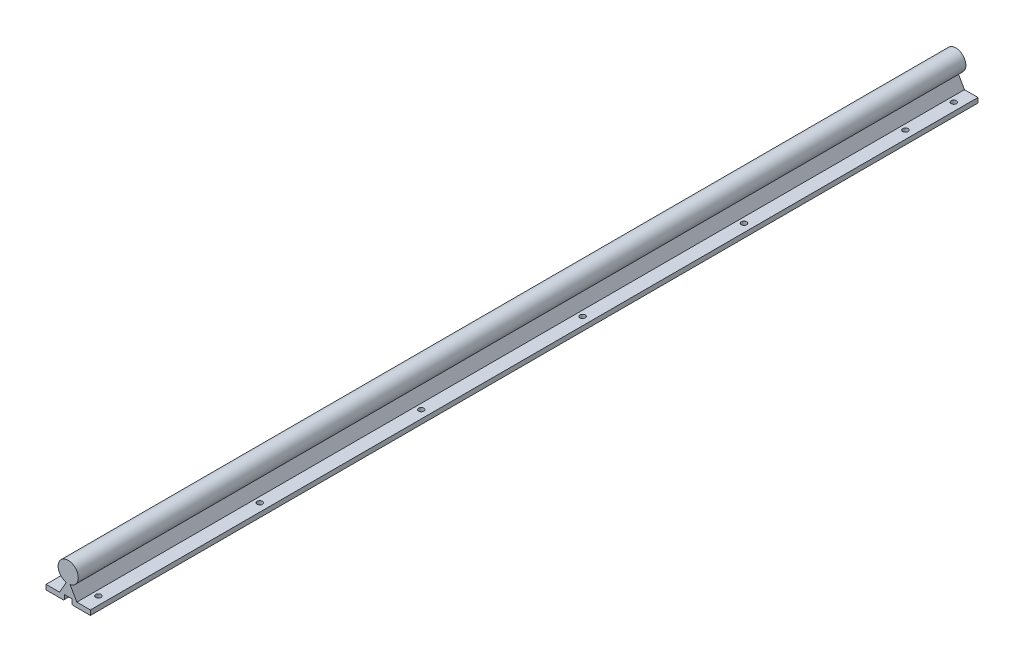
ISO-10303-21;
HEADER;
FILE_DESCRIPTION(('STEP AP214'),'2;1');
FILE_NAME('part.step','',(''),(''),'','','');
FILE_SCHEMA(('AUTOMOTIVE_DESIGN { 1 0 10303 214 1 1 1 1 }'));
ENDSEC;
DATA;
#1=APPLICATION_CONTEXT('core data for automotive mechanical design processes');
#2=APPLICATION_PROTOCOL_DEFINITION('international standard','automotive_design',2000,#1);
#3=PRODUCT_CONTEXT('',#1,'mechanical');
#4=PRODUCT('Part','Part','',(#3));
#5=PRODUCT_RELATED_PRODUCT_CATEGORY('part','',(#4));
#6=PRODUCT_DEFINITION_FORMATION('','',#4);
#7=PRODUCT_DEFINITION_CONTEXT('part definition',#1,'design');
#8=PRODUCT_DEFINITION('design','',#6,#7);
#9=PRODUCT_DEFINITION_SHAPE('','',#8);
#10=(LENGTH_UNIT() NAMED_UNIT(*) SI_UNIT(.MILLI.,.METRE.));
#11=(NAMED_UNIT(*) PLANE_ANGLE_UNIT() SI_UNIT($,.RADIAN.));
#12=(NAMED_UNIT(*) SI_UNIT($,.STERADIAN.) SOLID_ANGLE_UNIT());
#13=UNCERTAINTY_MEASURE_WITH_UNIT(LENGTH_MEASURE(1.E-05),#10,'distance_accuracy_value','');
#14=(GEOMETRIC_REPRESENTATION_CONTEXT(3) GLOBAL_UNCERTAINTY_ASSIGNED_CONTEXT((#13)) GLOBAL_UNIT_ASSIGNED_CONTEXT((#10,
#11,#12)) REPRESENTATION_CONTEXT('',''));
#15=CARTESIAN_POINT('',(0.,0.,0.));
#16=DIRECTION('',(0.,0.,1.));
#17=DIRECTION('',(1.,0.,0.));
#18=AXIS2_PLACEMENT_3D('',#15,#16,#17);
#19=CARTESIAN_POINT('',(0.,33.,-1100.));
#20=DIRECTION('',(0.,0.,1.));
#21=DIRECTION('',(1.,0.,0.));
#22=AXIS2_PLACEMENT_3D('',#19,#20,#21);
#23=CYLINDRICAL_SURFACE('',#22,12.5);
#24=CARTESIAN_POINT('',(0.,33.,0.));
#25=DIRECTION('',(0.,0.,1.));
#26=DIRECTION('',(1.,0.,0.));
#27=AXIS2_PLACEMENT_3D('',#24,#25,#26);
#28=CIRCLE('',#27,12.5);
#29=CARTESIAN_POINT('',(2.25953540055394,20.7059160661055,0.));
#30=VERTEX_POINT('',#29);
#31=CARTESIAN_POINT('',(-2.25953540055394,20.7059160661055,0.));
#32=VERTEX_POINT('',#31);
#33=EDGE_CURVE('E200',#30,#32,#28,.T.);
#34=ORIENTED_EDGE('',*,*,#33,.F.);
#35=DIRECTION('',(0.,0.,1.));
#36=VECTOR('',#35,1.);
#37=CARTESIAN_POINT('',(2.25953540055394,20.7059160661055,-1100.));
#38=LINE('',#37,#36);
#39=CARTESIAN_POINT('',(2.25953540055394,20.7059160661055,-1100.));
#40=VERTEX_POINT('',#39);
#41=EDGE_CURVE('E168',#40,#30,#38,.T.);
#42=ORIENTED_EDGE('',*,*,#41,.F.);
#43=CARTESIAN_POINT('',(0.,33.,-1100.));
#44=DIRECTION('',(0.,0.,1.));
#45=DIRECTION('',(1.,0.,0.));
#46=AXIS2_PLACEMENT_3D('',#43,#44,#45);
#47=CIRCLE('',#46,12.5);
#48=CARTESIAN_POINT('',(-2.25953540055394,20.7059160661055,-1100.));
#49=VERTEX_POINT('',#48);
#50=EDGE_CURVE('E149',#40,#49,#47,.T.);
#51=ORIENTED_EDGE('',*,*,#50,.T.);
#52=DIRECTION('',(0.,0.,1.));
#53=VECTOR('',#52,1.);
#54=CARTESIAN_POINT('',(-2.25953540055394,20.7059160661055,-1100.));
#55=LINE('',#54,#53);
#56=EDGE_CURVE('E158',#49,#32,#55,.T.);
#57=ORIENTED_EDGE('',*,*,#56,.T.);
#58=EDGE_LOOP('',(#34,#42,#51,#57));
#59=FACE_BOUND('',#58,.T.);
#60=ADVANCED_FACE('F41',(#59),#23,.T.);
#61=CARTESIAN_POINT('',(10.6605762113533,6.15488654534137,-1100.));
#62=DIRECTION('',(0.866025403784438,0.500000000000001,0.));
#63=DIRECTION('',(-0.500000000000001,0.866025403784438,0.));
#64=AXIS2_PLACEMENT_3D('',#61,#62,#63);
#65=PLANE('',#64);
#66=DIRECTION('',(-0.500000000000001,0.866025403784438,0.));
#67=VECTOR('',#66,1.);
#68=CARTESIAN_POINT('',(10.6605762113533,6.15488654534137,0.));
#69=LINE('',#68,#67);
#70=CARTESIAN_POINT('',(10.75,6.,0.));
#71=VERTEX_POINT('',#70);
#72=EDGE_CURVE('E169',#71,#30,#69,.T.);
#73=ORIENTED_EDGE('',*,*,#72,.F.);
#74=DIRECTION('',(0.,0.,1.));
#75=VECTOR('',#74,1.);
#76=CARTESIAN_POINT('',(10.75,6.,-1100.));
#77=LINE('',#76,#75);
#78=CARTESIAN_POINT('',(10.75,6.,-1100.));
#79=VERTEX_POINT('',#78);
#80=EDGE_CURVE('E226',#79,#71,#77,.T.);
#81=ORIENTED_EDGE('',*,*,#80,.F.);
#82=DIRECTION('',(-0.500000000000001,0.866025403784438,0.));
#83=VECTOR('',#82,1.);
#84=CARTESIAN_POINT('',(10.6605762113533,6.15488654534137,-1100.));
#85=LINE('',#84,#83);
#86=EDGE_CURVE('E166',#79,#40,#85,.T.);
#87=ORIENTED_EDGE('',*,*,#86,.T.);
#88=ORIENTED_EDGE('',*,*,#41,.T.);
#89=EDGE_LOOP('',(#73,#81,#87,#88));
#90=FACE_BOUND('',#89,.T.);
#91=ADVANCED_FACE('F312',(#90),#65,.T.);
#92=CARTESIAN_POINT('',(0.,6.,-1100.));
#93=DIRECTION('',(0.,1.,0.));
#94=DIRECTION('',(0.,0.,1.));
#95=AXIS2_PLACEMENT_3D('',#92,#93,#94);
#96=PLANE('',#95);
#97=CARTESIAN_POINT('',(17.5,6.,-1020.));
#98=DIRECTION('',(0.,1.,0.));
#99=DIRECTION('',(0.,0.,1.));
#100=AXIS2_PLACEMENT_3D('',#97,#98,#99);
#101=CIRCLE('',#100,3.30000000000002);
#102=CARTESIAN_POINT('',(17.5,6.,-1016.7));
#103=VERTEX_POINT('',#102);
#104=EDGE_CURVE('E175',#103,#103,#101,.T.);
#105=ORIENTED_EDGE('',*,*,#104,.F.);
#106=EDGE_LOOP('',(#105));
#107=FACE_BOUND('',#106,.T.);
#108=CARTESIAN_POINT('',(17.5,6.,-420.));
#109=DIRECTION('',(0.,1.,0.));
#110=DIRECTION('',(0.,0.,1.));
#111=AXIS2_PLACEMENT_3D('',#108,#109,#110);
#112=CIRCLE('',#111,3.30000000000001);
#113=CARTESIAN_POINT('',(17.5,6.,-416.7));
#114=VERTEX_POINT('',#113);
#115=EDGE_CURVE('E298',#114,#114,#112,.T.);
#116=ORIENTED_EDGE('',*,*,#115,.F.);
#117=EDGE_LOOP('',(#116));
#118=FACE_BOUND('',#117,.T.);
#119=CARTESIAN_POINT('',(17.5,6.,-220.));
#120=DIRECTION('',(0.,1.,0.));
#121=DIRECTION('',(0.,0.,1.));
#122=AXIS2_PLACEMENT_3D('',#119,#120,#121);
#123=CIRCLE('',#122,3.30000000000001);
#124=CARTESIAN_POINT('',(17.5,6.,-216.7));
#125=VERTEX_POINT('',#124);
#126=EDGE_CURVE('E296',#125,#125,#123,.T.);
#127=ORIENTED_EDGE('',*,*,#126,.F.);
#128=EDGE_LOOP('',(#127));
#129=FACE_BOUND('',#128,.T.);
#130=CARTESIAN_POINT('',(17.5,6.,-820.));
#131=DIRECTION('',(0.,1.,0.));
#132=DIRECTION('',(0.,0.,1.));
#133=AXIS2_PLACEMENT_3D('',#130,#131,#132);
#134=CIRCLE('',#133,3.30000000000002);
#135=CARTESIAN_POINT('',(17.5,6.,-816.7));
#136=VERTEX_POINT('',#135);
#137=EDGE_CURVE('E293',#136,#136,#134,.T.);
#138=ORIENTED_EDGE('',*,*,#137,.F.);
#139=EDGE_LOOP('',(#138));
#140=FACE_BOUND('',#139,.T.);
#141=CARTESIAN_POINT('',(17.5,6.,-620.));
#142=DIRECTION('',(0.,1.,0.));
#143=DIRECTION('',(0.,0.,1.));
#144=AXIS2_PLACEMENT_3D('',#141,#142,#143);
#145=CIRCLE('',#144,3.30000000000002);
#146=CARTESIAN_POINT('',(17.5,6.,-616.7));
#147=VERTEX_POINT('',#146);
#148=EDGE_CURVE('E286',#147,#147,#145,.T.);
#149=ORIENTED_EDGE('',*,*,#148,.F.);
#150=EDGE_LOOP('',(#149));
#151=FACE_BOUND('',#150,.T.);
#152=CARTESIAN_POINT('',(17.5,6.,-1080.));
#153=DIRECTION('',(0.,1.,0.));
#154=DIRECTION('',(0.,0.,1.));
#155=AXIS2_PLACEMENT_3D('',#152,#153,#154);
#156=CIRCLE('',#155,3.3000000000001);
#157=CARTESIAN_POINT('',(17.5,6.,-1076.7));
#158=VERTEX_POINT('',#157);
#159=EDGE_CURVE('E281',#158,#158,#156,.T.);
#160=ORIENTED_EDGE('',*,*,#159,.F.);
#161=EDGE_LOOP('',(#160));
#162=FACE_BOUND('',#161,.T.);
#163=CARTESIAN_POINT('',(17.5,6.,-20.));
#164=DIRECTION('',(0.,1.,0.));
#165=DIRECTION('',(0.,0.,1.));
#166=AXIS2_PLACEMENT_3D('',#163,#164,#165);
#167=CIRCLE('',#166,3.3);
#168=CARTESIAN_POINT('',(17.5,6.,-16.7));
#169=VERTEX_POINT('',#168);
#170=EDGE_CURVE('E277',#169,#169,#167,.T.);
#171=ORIENTED_EDGE('',*,*,#170,.F.);
#172=EDGE_LOOP('',(#171));
#173=FACE_BOUND('',#172,.T.);
#174=DIRECTION('',(-1.,0.,0.));
#175=VECTOR('',#174,1.);
#176=CARTESIAN_POINT('',(0.,6.,0.));
#177=LINE('',#176,#175);
#178=CARTESIAN_POINT('',(27.5,6.,0.));
#179=VERTEX_POINT('',#178);
#180=EDGE_CURVE('E172',#179,#71,#177,.T.);
#181=ORIENTED_EDGE('',*,*,#180,.F.);
#182=DIRECTION('',(0.,0.,1.));
#183=VECTOR('',#182,1.);
#184=CARTESIAN_POINT('',(27.5,6.,-1100.));
#185=LINE('',#184,#183);
#186=CARTESIAN_POINT('',(27.5,6.,-1100.));
#187=VERTEX_POINT('',#186);
#188=EDGE_CURVE('E228',#187,#179,#185,.T.);
#189=ORIENTED_EDGE('',*,*,#188,.F.);
#190=DIRECTION('',(-1.,0.,0.));
#191=VECTOR('',#190,1.);
#192=CARTESIAN_POINT('',(0.,6.,-1100.));
#193=LINE('',#192,#191);
#194=EDGE_CURVE('E196',#187,#79,#193,.T.);
#195=ORIENTED_EDGE('',*,*,#194,.T.);
#196=ORIENTED_EDGE('',*,*,#80,.T.);
#197=EDGE_LOOP('',(#181,#189,#195,#196));
#198=FACE_BOUND('',#197,.T.);
#199=ADVANCED_FACE('F308',(#107,#118,#129,#140,#151,#162,#173,#198),#96,.T.);
#200=CARTESIAN_POINT('',(27.5,0.,-1100.));
#201=DIRECTION('',(1.,0.,0.));
#202=DIRECTION('',(0.,0.,-1.));
#203=AXIS2_PLACEMENT_3D('',#200,#201,#202);
#204=PLANE('',#203);
#205=DIRECTION('',(0.,1.,0.));
#206=VECTOR('',#205,1.);
#207=CARTESIAN_POINT('',(27.5,0.,0.));
#208=LINE('',#207,#206);
#209=CARTESIAN_POINT('',(27.5,0.,0.));
#210=VERTEX_POINT('',#209);
#211=EDGE_CURVE('E219',#210,#179,#208,.T.);
#212=ORIENTED_EDGE('',*,*,#211,.F.);
#213=DIRECTION('',(0.,0.,1.));
#214=VECTOR('',#213,1.);
#215=CARTESIAN_POINT('',(27.5,0.,-1100.));
#216=LINE('',#215,#214);
#217=CARTESIAN_POINT('',(27.5,0.,-1100.));
#218=VERTEX_POINT('',#217);
#219=EDGE_CURVE('E230',#218,#210,#216,.T.);
#220=ORIENTED_EDGE('',*,*,#219,.F.);
#221=DIRECTION('',(0.,1.,0.));
#222=VECTOR('',#221,1.);
#223=CARTESIAN_POINT('',(27.5,0.,-1100.));
#224=LINE('',#223,#222);
#225=EDGE_CURVE('E193',#218,#187,#224,.T.);
#226=ORIENTED_EDGE('',*,*,#225,.T.);
#227=ORIENTED_EDGE('',*,*,#188,.T.);
#228=EDGE_LOOP('',(#212,#220,#226,#227));
#229=FACE_BOUND('',#228,.T.);
#230=ADVANCED_FACE('F311',(#229),#204,.T.);
#231=CARTESIAN_POINT('',(0.,0.,-1100.));
#232=DIRECTION('',(0.,1.,0.));
#233=DIRECTION('',(0.,0.,1.));
#234=AXIS2_PLACEMENT_3D('',#231,#232,#233);
#235=PLANE('',#234);
#236=CARTESIAN_POINT('',(17.5,0.,-1020.));
#237=DIRECTION('',(0.,1.,0.));
#238=DIRECTION('',(0.,0.,1.));
#239=AXIS2_PLACEMENT_3D('',#236,#237,#238);
#240=CIRCLE('',#239,3.30000000000002);
#241=CARTESIAN_POINT('',(17.5,0.,-1016.7));
#242=VERTEX_POINT('',#241);
#243=EDGE_CURVE('E463',#242,#242,#240,.T.);
#244=ORIENTED_EDGE('',*,*,#243,.T.);
#245=EDGE_LOOP('',(#244));
#246=FACE_BOUND('',#245,.T.);
#247=CARTESIAN_POINT('',(17.5,0.,-420.));
#248=DIRECTION('',(0.,1.,0.));
#249=DIRECTION('',(0.,0.,1.));
#250=AXIS2_PLACEMENT_3D('',#247,#248,#249);
#251=CIRCLE('',#250,3.30000000000001);
#252=CARTESIAN_POINT('',(17.5,0.,-416.7));
#253=VERTEX_POINT('',#252);
#254=EDGE_CURVE('E483',#253,#253,#251,.T.);
#255=ORIENTED_EDGE('',*,*,#254,.T.);
#256=EDGE_LOOP('',(#255));
#257=FACE_BOUND('',#256,.T.);
#258=CARTESIAN_POINT('',(17.5,0.,-220.));
#259=DIRECTION('',(0.,1.,0.));
#260=DIRECTION('',(0.,0.,1.));
#261=AXIS2_PLACEMENT_3D('',#258,#259,#260);
#262=CIRCLE('',#261,3.30000000000001);
#263=CARTESIAN_POINT('',(17.5,0.,-216.7));
#264=VERTEX_POINT('',#263);
#265=EDGE_CURVE('E489',#264,#264,#262,.T.);
#266=ORIENTED_EDGE('',*,*,#265,.T.);
#267=EDGE_LOOP('',(#266));
#268=FACE_BOUND('',#267,.T.);
#269=CARTESIAN_POINT('',(17.5,0.,-820.));
#270=DIRECTION('',(0.,1.,0.));
#271=DIRECTION('',(0.,0.,1.));
#272=AXIS2_PLACEMENT_3D('',#269,#270,#271);
#273=CIRCLE('',#272,3.30000000000002);
#274=CARTESIAN_POINT('',(17.5,0.,-816.7));
#275=VERTEX_POINT('',#274);
#276=EDGE_CURVE('E471',#275,#275,#273,.T.);
#277=ORIENTED_EDGE('',*,*,#276,.T.);
#278=EDGE_LOOP('',(#277));
#279=FACE_BOUND('',#278,.T.);
#280=CARTESIAN_POINT('',(17.5,0.,-620.));
#281=DIRECTION('',(0.,1.,0.));
#282=DIRECTION('',(0.,0.,1.));
#283=AXIS2_PLACEMENT_3D('',#280,#281,#282);
#284=CIRCLE('',#283,3.30000000000002);
#285=CARTESIAN_POINT('',(17.5,0.,-616.7));
#286=VERTEX_POINT('',#285);
#287=EDGE_CURVE('E477',#286,#286,#284,.T.);
#288=ORIENTED_EDGE('',*,*,#287,.T.);
#289=EDGE_LOOP('',(#288));
#290=FACE_BOUND('',#289,.T.);
#291=CARTESIAN_POINT('',(17.5,0.,-1080.));
#292=DIRECTION('',(0.,1.,0.));
#293=DIRECTION('',(0.,0.,1.));
#294=AXIS2_PLACEMENT_3D('',#291,#292,#293);
#295=CIRCLE('',#294,3.3000000000001);
#296=CARTESIAN_POINT('',(17.5,0.,-1076.7));
#297=VERTEX_POINT('',#296);
#298=EDGE_CURVE('E457',#297,#297,#295,.T.);
#299=ORIENTED_EDGE('',*,*,#298,.T.);
#300=EDGE_LOOP('',(#299));
#301=FACE_BOUND('',#300,.T.);
#302=CARTESIAN_POINT('',(17.5,0.,-20.));
#303=DIRECTION('',(0.,1.,0.));
#304=DIRECTION('',(0.,0.,1.));
#305=AXIS2_PLACEMENT_3D('',#302,#303,#304);
#306=CIRCLE('',#305,3.3);
#307=CARTESIAN_POINT('',(17.5,0.,-16.7));
#308=VERTEX_POINT('',#307);
#309=EDGE_CURVE('E261',#308,#308,#306,.T.);
#310=ORIENTED_EDGE('',*,*,#309,.T.);
#311=EDGE_LOOP('',(#310));
#312=FACE_BOUND('',#311,.T.);
#313=DIRECTION('',(-1.,0.,0.));
#314=VECTOR('',#313,1.);
#315=CARTESIAN_POINT('',(0.,0.,0.));
#316=LINE('',#315,#314);
#317=CARTESIAN_POINT('',(5.75,0.,0.));
#318=VERTEX_POINT('',#317);
#319=EDGE_CURVE('E217',#210,#318,#316,.T.);
#320=ORIENTED_EDGE('',*,*,#319,.T.);
#321=DIRECTION('',(0.,0.,-1.));
#322=VECTOR('',#321,1.);
#323=CARTESIAN_POINT('',(5.75,0.,-1100.));
#324=LINE('',#323,#322);
#325=CARTESIAN_POINT('',(5.75,0.,-1100.));
#326=VERTEX_POINT('',#325);
#327=EDGE_CURVE('E11',#318,#326,#324,.T.);
#328=ORIENTED_EDGE('',*,*,#327,.T.);
#329=DIRECTION('',(-1.,0.,0.));
#330=VECTOR('',#329,1.);
#331=CARTESIAN_POINT('',(0.,0.,-1100.));
#332=LINE('',#331,#330);
#333=EDGE_CURVE('E191',#218,#326,#332,.T.);
#334=ORIENTED_EDGE('',*,*,#333,.F.);
#335=ORIENTED_EDGE('',*,*,#219,.T.);
#336=EDGE_LOOP('',(#320,#328,#334,#335));
#337=FACE_BOUND('',#336,.T.);
#338=ADVANCED_FACE('F396',(#246,#257,#268,#279,#290,#301,#312,#337),#235,.F.);
#339=CARTESIAN_POINT('',(4.75,0.,-1100.));
#340=DIRECTION('',(1.,0.,0.));
#341=DIRECTION('',(0.,0.,-1.));
#342=AXIS2_PLACEMENT_3D('',#339,#340,#341);
#343=PLANE('',#342);
#344=DIRECTION('',(0.,1.,0.));
#345=VECTOR('',#344,1.);
#346=CARTESIAN_POINT('',(4.75,0.,-1100.));
#347=LINE('',#346,#345);
#348=CARTESIAN_POINT('',(4.75,1.00000000000011,-1100.));
#349=VERTEX_POINT('',#348);
#350=CARTESIAN_POINT('',(4.75,6.5,-1100.));
#351=VERTEX_POINT('',#350);
#352=EDGE_CURVE('E189',#349,#351,#347,.T.);
#353=ORIENTED_EDGE('',*,*,#352,.F.);
#354=DIRECTION('',(0.,0.,1.));
#355=VECTOR('',#354,1.);
#356=CARTESIAN_POINT('',(4.75,1.00000000000011,-1100.));
#357=LINE('',#356,#355);
#358=CARTESIAN_POINT('',(4.75,1.00000000000011,0.));
#359=VERTEX_POINT('',#358);
#360=EDGE_CURVE('E50',#349,#359,#357,.T.);
#361=ORIENTED_EDGE('',*,*,#360,.T.);
#362=DIRECTION('',(0.,1.,0.));
#363=VECTOR('',#362,1.);
#364=CARTESIAN_POINT('',(4.75,0.,0.));
#365=LINE('',#364,#363);
#366=CARTESIAN_POINT('',(4.75,6.5,0.));
#367=VERTEX_POINT('',#366);
#368=EDGE_CURVE('E215',#359,#367,#365,.T.);
#369=ORIENTED_EDGE('',*,*,#368,.T.);
#370=DIRECTION('',(0.,0.,1.));
#371=VECTOR('',#370,1.);
#372=CARTESIAN_POINT('',(4.75,6.5,-1100.));
#373=LINE('',#372,#371);
#374=EDGE_CURVE('E232',#351,#367,#373,.T.);
#375=ORIENTED_EDGE('',*,*,#374,.F.);
#376=EDGE_LOOP('',(#353,#361,#369,#375));
#377=FACE_BOUND('',#376,.T.);
#378=ADVANCED_FACE('F362',(#377),#343,.F.);
#379=CARTESIAN_POINT('',(0.,6.5,-1100.));
#380=DIRECTION('',(0.,-1.,0.));
#381=DIRECTION('',(0.,0.,-1.));
#382=AXIS2_PLACEMENT_3D('',#379,#380,#381);
#383=PLANE('',#382);
#384=DIRECTION('',(1.,0.,0.));
#385=VECTOR('',#384,1.);
#386=CARTESIAN_POINT('',(0.,6.5,0.));
#387=LINE('',#386,#385);
#388=CARTESIAN_POINT('',(-4.75,6.5,0.));
#389=VERTEX_POINT('',#388);
#390=EDGE_CURVE('E212',#389,#367,#387,.T.);
#391=ORIENTED_EDGE('',*,*,#390,.F.);
#392=DIRECTION('',(0.,0.,1.));
#393=VECTOR('',#392,1.);
#394=CARTESIAN_POINT('',(-4.75,6.5,-1100.));
#395=LINE('',#394,#393);
#396=CARTESIAN_POINT('',(-4.75,6.5,-1100.));
#397=VERTEX_POINT('',#396);
#398=EDGE_CURVE('E235',#397,#389,#395,.T.);
#399=ORIENTED_EDGE('',*,*,#398,.F.);
#400=DIRECTION('',(1.,0.,0.));
#401=VECTOR('',#400,1.);
#402=CARTESIAN_POINT('',(0.,6.5,-1100.));
#403=LINE('',#402,#401);
#404=EDGE_CURVE('E186',#397,#351,#403,.T.);
#405=ORIENTED_EDGE('',*,*,#404,.T.);
#406=ORIENTED_EDGE('',*,*,#374,.T.);
#407=EDGE_LOOP('',(#391,#399,#405,#406));
#408=FACE_BOUND('',#407,.T.);
#409=ADVANCED_FACE('F358',(#408),#383,.T.);
#410=CARTESIAN_POINT('',(-4.75,0.,-1100.));
#411=DIRECTION('',(1.,0.,0.));
#412=DIRECTION('',(0.,0.,-1.));
#413=AXIS2_PLACEMENT_3D('',#410,#411,#412);
#414=PLANE('',#413);
#415=DIRECTION('',(0.,1.,0.));
#416=VECTOR('',#415,1.);
#417=CARTESIAN_POINT('',(-4.75,0.,0.));
#418=LINE('',#417,#416);
#419=CARTESIAN_POINT('',(-4.75,1.,0.));
#420=VERTEX_POINT('',#419);
#421=EDGE_CURVE('E210',#420,#389,#418,.T.);
#422=ORIENTED_EDGE('',*,*,#421,.F.);
#423=DIRECTION('',(0.,0.,-1.));
#424=VECTOR('',#423,1.);
#425=CARTESIAN_POINT('',(-4.75,1.,-1100.));
#426=LINE('',#425,#424);
#427=CARTESIAN_POINT('',(-4.75,1.,-1100.));
#428=VERTEX_POINT('',#427);
#429=EDGE_CURVE('E250',#420,#428,#426,.T.);
#430=ORIENTED_EDGE('',*,*,#429,.T.);
#431=DIRECTION('',(0.,1.,0.));
#432=VECTOR('',#431,1.);
#433=CARTESIAN_POINT('',(-4.75,0.,-1100.));
#434=LINE('',#433,#432);
#435=EDGE_CURVE('E184',#428,#397,#434,.T.);
#436=ORIENTED_EDGE('',*,*,#435,.T.);
#437=ORIENTED_EDGE('',*,*,#398,.T.);
#438=EDGE_LOOP('',(#422,#430,#436,#437));
#439=FACE_BOUND('',#438,.T.);
#440=ADVANCED_FACE('F351',(#439),#414,.T.);
#441=CARTESIAN_POINT('',(0.,0.,-1100.));
#442=DIRECTION('',(0.,-1.,0.));
#443=DIRECTION('',(0.,0.,-1.));
#444=AXIS2_PLACEMENT_3D('',#441,#442,#443);
#445=PLANE('',#444);
#446=CARTESIAN_POINT('',(-17.5,0.,-1020.));
#447=DIRECTION('',(0.,1.,0.));
#448=DIRECTION('',(0.,0.,-1.));
#449=AXIS2_PLACEMENT_3D('',#446,#447,#448);
#450=CIRCLE('',#449,3.30000000000002);
#451=CARTESIAN_POINT('',(-17.5,0.,-1023.3));
#452=VERTEX_POINT('',#451);
#453=EDGE_CURVE('E459',#452,#452,#450,.T.);
#454=ORIENTED_EDGE('',*,*,#453,.T.);
#455=EDGE_LOOP('',(#454));
#456=FACE_BOUND('',#455,.T.);
#457=CARTESIAN_POINT('',(-17.5,0.,-820.));
#458=DIRECTION('',(0.,1.,0.));
#459=DIRECTION('',(0.,0.,-1.));
#460=AXIS2_PLACEMENT_3D('',#457,#458,#459);
#461=CIRCLE('',#460,3.30000000000002);
#462=CARTESIAN_POINT('',(-17.5,0.,-823.3));
#463=VERTEX_POINT('',#462);
#464=EDGE_CURVE('E468',#463,#463,#461,.T.);
#465=ORIENTED_EDGE('',*,*,#464,.T.);
#466=EDGE_LOOP('',(#465));
#467=FACE_BOUND('',#466,.T.);
#468=CARTESIAN_POINT('',(-17.5,0.,-220.));
#469=DIRECTION('',(0.,1.,0.));
#470=DIRECTION('',(0.,0.,-1.));
#471=AXIS2_PLACEMENT_3D('',#468,#469,#470);
#472=CIRCLE('',#471,3.30000000000001);
#473=CARTESIAN_POINT('',(-17.5,0.,-223.3));
#474=VERTEX_POINT('',#473);
#475=EDGE_CURVE('E486',#474,#474,#472,.T.);
#476=ORIENTED_EDGE('',*,*,#475,.T.);
#477=EDGE_LOOP('',(#476));
#478=FACE_BOUND('',#477,.T.);
#479=CARTESIAN_POINT('',(-17.5,0.,-20.));
#480=DIRECTION('',(0.,1.,0.));
#481=DIRECTION('',(0.,0.,-1.));
#482=AXIS2_PLACEMENT_3D('',#479,#480,#481);
#483=CIRCLE('',#482,3.3);
#484=CARTESIAN_POINT('',(-17.5,0.,-23.3));
#485=VERTEX_POINT('',#484);
#486=EDGE_CURVE('E492',#485,#485,#483,.T.);
#487=ORIENTED_EDGE('',*,*,#486,.T.);
#488=EDGE_LOOP('',(#487));
#489=FACE_BOUND('',#488,.T.);
#490=CARTESIAN_POINT('',(-17.5,0.,-620.));
#491=DIRECTION('',(0.,1.,0.));
#492=DIRECTION('',(0.,0.,-1.));
#493=AXIS2_PLACEMENT_3D('',#490,#491,#492);
#494=CIRCLE('',#493,3.30000000000002);
#495=CARTESIAN_POINT('',(-17.5,0.,-623.3));
#496=VERTEX_POINT('',#495);
#497=EDGE_CURVE('E474',#496,#496,#494,.T.);
#498=ORIENTED_EDGE('',*,*,#497,.T.);
#499=EDGE_LOOP('',(#498));
#500=FACE_BOUND('',#499,.T.);
#501=CARTESIAN_POINT('',(-17.5,0.,-420.));
#502=DIRECTION('',(0.,1.,0.));
#503=DIRECTION('',(0.,0.,-1.));
#504=AXIS2_PLACEMENT_3D('',#501,#502,#503);
#505=CIRCLE('',#504,3.30000000000001);
#506=CARTESIAN_POINT('',(-17.5,0.,-423.3));
#507=VERTEX_POINT('',#506);
#508=EDGE_CURVE('E480',#507,#507,#505,.T.);
#509=ORIENTED_EDGE('',*,*,#508,.T.);
#510=EDGE_LOOP('',(#509));
#511=FACE_BOUND('',#510,.T.);
#512=CARTESIAN_POINT('',(-17.5,0.,-1080.));
#513=DIRECTION('',(0.,1.,0.));
#514=DIRECTION('',(0.,0.,-1.));
#515=AXIS2_PLACEMENT_3D('',#512,#513,#514);
#516=CIRCLE('',#515,3.3000000000001);
#517=CARTESIAN_POINT('',(-17.5,0.,-1083.3));
#518=VERTEX_POINT('',#517);
#519=EDGE_CURVE('E460',#518,#518,#516,.T.);
#520=ORIENTED_EDGE('',*,*,#519,.T.);
#521=EDGE_LOOP('',(#520));
#522=FACE_BOUND('',#521,.T.);
#523=DIRECTION('',(1.,0.,0.));
#524=VECTOR('',#523,1.);
#525=CARTESIAN_POINT('',(0.,0.,-1100.));
#526=LINE('',#525,#524);
#527=CARTESIAN_POINT('',(-27.5,0.,-1100.));
#528=VERTEX_POINT('',#527);
#529=CARTESIAN_POINT('',(-5.75000000000011,0.,-1100.));
#530=VERTEX_POINT('',#529);
#531=EDGE_CURVE('E181',#528,#530,#526,.T.);
#532=ORIENTED_EDGE('',*,*,#531,.T.);
#533=DIRECTION('',(0.,0.,1.));
#534=VECTOR('',#533,1.);
#535=CARTESIAN_POINT('',(-5.75000000000011,0.,-1100.));
#536=LINE('',#535,#534);
#537=CARTESIAN_POINT('',(-5.75000000000011,0.,0.));
#538=VERTEX_POINT('',#537);
#539=EDGE_CURVE('E225',#530,#538,#536,.T.);
#540=ORIENTED_EDGE('',*,*,#539,.T.);
#541=DIRECTION('',(1.,0.,0.));
#542=VECTOR('',#541,1.);
#543=CARTESIAN_POINT('',(0.,0.,0.));
#544=LINE('',#543,#542);
#545=CARTESIAN_POINT('',(-27.5,0.,0.));
#546=VERTEX_POINT('',#545);
#547=EDGE_CURVE('E207',#546,#538,#544,.T.);
#548=ORIENTED_EDGE('',*,*,#547,.F.);
#549=DIRECTION('',(0.,0.,1.));
#550=VECTOR('',#549,1.);
#551=CARTESIAN_POINT('',(-27.5,0.,-1100.));
#552=LINE('',#551,#550);
#553=EDGE_CURVE('E238',#528,#546,#552,.T.);
#554=ORIENTED_EDGE('',*,*,#553,.F.);
#555=EDGE_LOOP('',(#532,#540,#548,#554));
#556=FACE_BOUND('',#555,.T.);
#557=ADVANCED_FACE('F345',(#456,#467,#478,#489,#500,#511,#522,#556),#445,.T.);
#558=CARTESIAN_POINT('',(-27.5,0.,-1100.));
#559=DIRECTION('',(1.,0.,0.));
#560=DIRECTION('',(0.,0.,-1.));
#561=AXIS2_PLACEMENT_3D('',#558,#559,#560);
#562=PLANE('',#561);
#563=DIRECTION('',(0.,1.,0.));
#564=VECTOR('',#563,1.);
#565=CARTESIAN_POINT('',(-27.5,0.,0.));
#566=LINE('',#565,#564);
#567=CARTESIAN_POINT('',(-27.5,6.,0.));
#568=VERTEX_POINT('',#567);
#569=EDGE_CURVE('E205',#546,#568,#566,.T.);
#570=ORIENTED_EDGE('',*,*,#569,.T.);
#571=DIRECTION('',(0.,0.,1.));
#572=VECTOR('',#571,1.);
#573=CARTESIAN_POINT('',(-27.5,6.,-1100.));
#574=LINE('',#573,#572);
#575=CARTESIAN_POINT('',(-27.5,6.,-1100.));
#576=VERTEX_POINT('',#575);
#577=EDGE_CURVE('E240',#576,#568,#574,.T.);
#578=ORIENTED_EDGE('',*,*,#577,.F.);
#579=DIRECTION('',(0.,1.,0.));
#580=VECTOR('',#579,1.);
#581=CARTESIAN_POINT('',(-27.5,0.,-1100.));
#582=LINE('',#581,#580);
#583=EDGE_CURVE('E179',#528,#576,#582,.T.);
#584=ORIENTED_EDGE('',*,*,#583,.F.);
#585=ORIENTED_EDGE('',*,*,#553,.T.);
#586=EDGE_LOOP('',(#570,#578,#584,#585));
#587=FACE_BOUND('',#586,.T.);
#588=ADVANCED_FACE('F342',(#587),#562,.F.);
#589=CARTESIAN_POINT('',(0.,6.,-1100.));
#590=DIRECTION('',(0.,-1.,0.));
#591=DIRECTION('',(0.,0.,-1.));
#592=AXIS2_PLACEMENT_3D('',#589,#590,#591);
#593=PLANE('',#592);
#594=CARTESIAN_POINT('',(-17.5,6.,-1020.));
#595=DIRECTION('',(0.,-1.,0.));
#596=DIRECTION('',(0.,0.,-1.));
#597=AXIS2_PLACEMENT_3D('',#594,#595,#596);
#598=CIRCLE('',#597,3.30000000000002);
#599=CARTESIAN_POINT('',(-17.5,6.,-1023.3));
#600=VERTEX_POINT('',#599);
#601=EDGE_CURVE('E45',#600,#600,#598,.T.);
#602=ORIENTED_EDGE('',*,*,#601,.T.);
#603=EDGE_LOOP('',(#602));
#604=FACE_BOUND('',#603,.T.);
#605=CARTESIAN_POINT('',(-17.5,6.,-820.));
#606=DIRECTION('',(0.,-1.,0.));
#607=DIRECTION('',(0.,0.,-1.));
#608=AXIS2_PLACEMENT_3D('',#605,#606,#607);
#609=CIRCLE('',#608,3.30000000000002);
#610=CARTESIAN_POINT('',(-17.5,6.,-823.3));
#611=VERTEX_POINT('',#610);
#612=EDGE_CURVE('E272',#611,#611,#609,.T.);
#613=ORIENTED_EDGE('',*,*,#612,.T.);
#614=EDGE_LOOP('',(#613));
#615=FACE_BOUND('',#614,.T.);
#616=CARTESIAN_POINT('',(-17.5,6.,-220.));
#617=DIRECTION('',(0.,-1.,0.));
#618=DIRECTION('',(0.,0.,-1.));
#619=AXIS2_PLACEMENT_3D('',#616,#617,#618);
#620=CIRCLE('',#619,3.30000000000001);
#621=CARTESIAN_POINT('',(-17.5,6.,-223.3));
#622=VERTEX_POINT('',#621);
#623=EDGE_CURVE('E270',#622,#622,#620,.T.);
#624=ORIENTED_EDGE('',*,*,#623,.T.);
#625=EDGE_LOOP('',(#624));
#626=FACE_BOUND('',#625,.T.);
#627=CARTESIAN_POINT('',(-17.5,6.,-20.));
#628=DIRECTION('',(0.,-1.,0.));
#629=DIRECTION('',(0.,0.,-1.));
#630=AXIS2_PLACEMENT_3D('',#627,#628,#629);
#631=CIRCLE('',#630,3.3);
#632=CARTESIAN_POINT('',(-17.5,6.,-23.3));
#633=VERTEX_POINT('',#632);
#634=EDGE_CURVE('E267',#633,#633,#631,.T.);
#635=ORIENTED_EDGE('',*,*,#634,.T.);
#636=EDGE_LOOP('',(#635));
#637=FACE_BOUND('',#636,.T.);
#638=CARTESIAN_POINT('',(-17.5,6.,-620.));
#639=DIRECTION('',(0.,-1.,0.));
#640=DIRECTION('',(0.,0.,-1.));
#641=AXIS2_PLACEMENT_3D('',#638,#639,#640);
#642=CIRCLE('',#641,3.30000000000002);
#643=CARTESIAN_POINT('',(-17.5,6.,-623.3));
#644=VERTEX_POINT('',#643);
#645=EDGE_CURVE('E264',#644,#644,#642,.T.);
#646=ORIENTED_EDGE('',*,*,#645,.T.);
#647=EDGE_LOOP('',(#646));
#648=FACE_BOUND('',#647,.T.);
#649=CARTESIAN_POINT('',(-17.5,6.,-420.));
#650=DIRECTION('',(0.,-1.,0.));
#651=DIRECTION('',(0.,0.,-1.));
#652=AXIS2_PLACEMENT_3D('',#649,#650,#651);
#653=CIRCLE('',#652,3.30000000000001);
#654=CARTESIAN_POINT('',(-17.5,6.,-423.3));
#655=VERTEX_POINT('',#654);
#656=EDGE_CURVE('E260',#655,#655,#653,.T.);
#657=ORIENTED_EDGE('',*,*,#656,.T.);
#658=EDGE_LOOP('',(#657));
#659=FACE_BOUND('',#658,.T.);
#660=CARTESIAN_POINT('',(-17.5,6.,-1080.));
#661=DIRECTION('',(0.,-1.,0.));
#662=DIRECTION('',(0.,0.,-1.));
#663=AXIS2_PLACEMENT_3D('',#660,#661,#662);
#664=CIRCLE('',#663,3.3000000000001);
#665=CARTESIAN_POINT('',(-17.5,6.,-1083.3));
#666=VERTEX_POINT('',#665);
#667=EDGE_CURVE('E257',#666,#666,#664,.T.);
#668=ORIENTED_EDGE('',*,*,#667,.T.);
#669=EDGE_LOOP('',(#668));
#670=FACE_BOUND('',#669,.T.);
#671=DIRECTION('',(1.,0.,0.));
#672=VECTOR('',#671,1.);
#673=CARTESIAN_POINT('',(0.,6.,0.));
#674=LINE('',#673,#672);
#675=CARTESIAN_POINT('',(-10.75,6.,0.));
#676=VERTEX_POINT('',#675);
#677=EDGE_CURVE('E203',#568,#676,#674,.T.);
#678=ORIENTED_EDGE('',*,*,#677,.T.);
#679=DIRECTION('',(0.,0.,1.));
#680=VECTOR('',#679,1.);
#681=CARTESIAN_POINT('',(-10.75,6.,-1100.));
#682=LINE('',#681,#680);
#683=CARTESIAN_POINT('',(-10.75,6.,-1100.));
#684=VERTEX_POINT('',#683);
#685=EDGE_CURVE('E165',#684,#676,#682,.T.);
#686=ORIENTED_EDGE('',*,*,#685,.F.);
#687=DIRECTION('',(1.,0.,0.));
#688=VECTOR('',#687,1.);
#689=CARTESIAN_POINT('',(0.,6.,-1100.));
#690=LINE('',#689,#688);
#691=EDGE_CURVE('E152',#576,#684,#690,.T.);
#692=ORIENTED_EDGE('',*,*,#691,.F.);
#693=ORIENTED_EDGE('',*,*,#577,.T.);
#694=EDGE_LOOP('',(#678,#686,#692,#693));
#695=FACE_BOUND('',#694,.T.);
#696=ADVANCED_FACE('F338',(#604,#615,#626,#637,#648,#659,#670,#695),#593,.F.);
#697=CARTESIAN_POINT('',(-10.6605762113533,6.15488654534137,-1100.));
#698=DIRECTION('',(0.866025403784438,-0.500000000000001,0.));
#699=DIRECTION('',(0.500000000000001,0.866025403784438,0.));
#700=AXIS2_PLACEMENT_3D('',#697,#698,#699);
#701=PLANE('',#700);
#702=DIRECTION('',(0.500000000000001,0.866025403784438,0.));
#703=VECTOR('',#702,1.);
#704=CARTESIAN_POINT('',(-10.6605762113533,6.15488654534137,0.));
#705=LINE('',#704,#703);
#706=EDGE_CURVE('E161',#676,#32,#705,.T.);
#707=ORIENTED_EDGE('',*,*,#706,.T.);
#708=ORIENTED_EDGE('',*,*,#56,.F.);
#709=DIRECTION('',(0.500000000000001,0.866025403784438,0.));
#710=VECTOR('',#709,1.);
#711=CARTESIAN_POINT('',(-10.6605762113533,6.15488654534137,-1100.));
#712=LINE('',#711,#710);
#713=EDGE_CURVE('E143',#684,#49,#712,.T.);
#714=ORIENTED_EDGE('',*,*,#713,.F.);
#715=ORIENTED_EDGE('',*,*,#685,.T.);
#716=EDGE_LOOP('',(#707,#708,#714,#715));
#717=FACE_BOUND('',#716,.T.);
#718=ADVANCED_FACE('F159',(#717),#701,.F.);
#719=CARTESIAN_POINT('',(0.,0.,-1100.));
#720=DIRECTION('',(0.,0.,1.));
#721=DIRECTION('',(1.,0.,0.));
#722=AXIS2_PLACEMENT_3D('',#719,#720,#721);
#723=PLANE('',#722);
#724=ORIENTED_EDGE('',*,*,#435,.F.);
#725=DIRECTION('',(0.707106781186587,0.707106781186508,0.));
#726=VECTOR('',#725,1.);
#727=CARTESIAN_POINT('',(-5.75000000000011,0.,-1100.));
#728=LINE('',#727,#726);
#729=EDGE_CURVE('E253',#428,#530,#728,.F.);
#730=ORIENTED_EDGE('',*,*,#729,.T.);
#731=ORIENTED_EDGE('',*,*,#531,.F.);
#732=ORIENTED_EDGE('',*,*,#583,.T.);
#733=ORIENTED_EDGE('',*,*,#691,.T.);
#734=ORIENTED_EDGE('',*,*,#713,.T.);
#735=ORIENTED_EDGE('',*,*,#50,.F.);
#736=ORIENTED_EDGE('',*,*,#86,.F.);
#737=ORIENTED_EDGE('',*,*,#194,.F.);
#738=ORIENTED_EDGE('',*,*,#225,.F.);
#739=ORIENTED_EDGE('',*,*,#333,.T.);
#740=DIRECTION('',(0.707106781186508,-0.707106781186587,0.));
#741=VECTOR('',#740,1.);
#742=CARTESIAN_POINT('',(4.75,1.00000000000011,-1100.));
#743=LINE('',#742,#741);
#744=EDGE_CURVE('E58',#326,#349,#743,.F.);
#745=ORIENTED_EDGE('',*,*,#744,.T.);
#746=ORIENTED_EDGE('',*,*,#352,.T.);
#747=ORIENTED_EDGE('',*,*,#404,.F.);
#748=EDGE_LOOP('',(#724,#730,#731,#732,#733,#734,#735,#736,#737,#738,#739,#745,#746,#747));
#749=FACE_BOUND('',#748,.T.);
#750=ADVANCED_FACE('F146',(#749),#723,.F.);
#751=CARTESIAN_POINT('',(0.,0.,0.));
#752=DIRECTION('',(0.,0.,1.));
#753=DIRECTION('',(1.,0.,0.));
#754=AXIS2_PLACEMENT_3D('',#751,#752,#753);
#755=PLANE('',#754);
#756=ORIENTED_EDGE('',*,*,#547,.T.);
#757=DIRECTION('',(-0.707106781186587,-0.707106781186508,0.));
#758=VECTOR('',#757,1.);
#759=CARTESIAN_POINT('',(-2.87499999999974,2.87500000000006,0.));
#760=LINE('',#759,#758);
#761=EDGE_CURVE('E248',#538,#420,#760,.F.);
#762=ORIENTED_EDGE('',*,*,#761,.T.);
#763=ORIENTED_EDGE('',*,*,#421,.T.);
#764=ORIENTED_EDGE('',*,*,#390,.T.);
#765=ORIENTED_EDGE('',*,*,#368,.F.);
#766=DIRECTION('',(-0.707106781186508,0.707106781186587,0.));
#767=VECTOR('',#766,1.);
#768=CARTESIAN_POINT('',(2.87500000000032,2.875,0.));
#769=LINE('',#768,#767);
#770=EDGE_CURVE('E246',#359,#318,#769,.F.);
#771=ORIENTED_EDGE('',*,*,#770,.T.);
#772=ORIENTED_EDGE('',*,*,#319,.F.);
#773=ORIENTED_EDGE('',*,*,#211,.T.);
#774=ORIENTED_EDGE('',*,*,#180,.T.);
#775=ORIENTED_EDGE('',*,*,#72,.T.);
#776=ORIENTED_EDGE('',*,*,#33,.T.);
#777=ORIENTED_EDGE('',*,*,#706,.F.);
#778=ORIENTED_EDGE('',*,*,#677,.F.);
#779=ORIENTED_EDGE('',*,*,#569,.F.);
#780=EDGE_LOOP('',(#756,#762,#763,#764,#765,#771,#772,#773,#774,#775,#776,#777,#778,#779));
#781=FACE_BOUND('',#780,.T.);
#782=ADVANCED_FACE('F330',(#781),#755,.T.);
#783=CARTESIAN_POINT('',(-5.75000000000011,0.,-1100.));
#784=DIRECTION('',(-0.707106781186508,0.707106781186587,0.));
#785=DIRECTION('',(0.,0.,1.));
#786=AXIS2_PLACEMENT_3D('',#783,#784,#785);
#787=PLANE('',#786);
#788=ORIENTED_EDGE('',*,*,#729,.F.);
#789=ORIENTED_EDGE('',*,*,#429,.F.);
#790=ORIENTED_EDGE('',*,*,#761,.F.);
#791=ORIENTED_EDGE('',*,*,#539,.F.);
#792=EDGE_LOOP('',(#788,#789,#790,#791));
#793=FACE_BOUND('',#792,.T.);
#794=ADVANCED_FACE('F355',(#793),#787,.F.);
#795=CARTESIAN_POINT('',(4.75,1.00000000000011,-1100.));
#796=DIRECTION('',(0.707106781186587,0.707106781186508,0.));
#797=DIRECTION('',(0.,0.,1.));
#798=AXIS2_PLACEMENT_3D('',#795,#796,#797);
#799=PLANE('',#798);
#800=ORIENTED_EDGE('',*,*,#744,.F.);
#801=ORIENTED_EDGE('',*,*,#327,.F.);
#802=ORIENTED_EDGE('',*,*,#770,.F.);
#803=ORIENTED_EDGE('',*,*,#360,.F.);
#804=EDGE_LOOP('',(#800,#801,#802,#803));
#805=FACE_BOUND('',#804,.T.);
#806=ADVANCED_FACE('F43',(#805),#799,.F.);
#807=CARTESIAN_POINT('',(-17.5,0.,-1080.));
#808=DIRECTION('',(0.,1.,0.));
#809=DIRECTION('',(0.,0.,1.));
#810=AXIS2_PLACEMENT_3D('',#807,#808,#809);
#811=CYLINDRICAL_SURFACE('',#810,3.3000000000001);
#812=ORIENTED_EDGE('',*,*,#519,.F.);
#813=EDGE_LOOP('',(#812));
#814=FACE_BOUND('',#813,.T.);
#815=ORIENTED_EDGE('',*,*,#667,.F.);
#816=EDGE_LOOP('',(#815));
#817=FACE_BOUND('',#816,.T.);
#818=ADVANCED_FACE('F366',(#814,#817),#811,.F.);
#819=CARTESIAN_POINT('',(-17.5,0.,-420.));
#820=DIRECTION('',(0.,1.,0.));
#821=DIRECTION('',(0.,0.,1.));
#822=AXIS2_PLACEMENT_3D('',#819,#820,#821);
#823=CYLINDRICAL_SURFACE('',#822,3.30000000000001);
#824=ORIENTED_EDGE('',*,*,#508,.F.);
#825=EDGE_LOOP('',(#824));
#826=FACE_BOUND('',#825,.T.);
#827=ORIENTED_EDGE('',*,*,#656,.F.);
#828=EDGE_LOOP('',(#827));
#829=FACE_BOUND('',#828,.T.);
#830=ADVANCED_FACE('F371',(#826,#829),#823,.F.);
#831=CARTESIAN_POINT('',(-17.5,0.,-620.));
#832=DIRECTION('',(0.,1.,0.));
#833=DIRECTION('',(0.,0.,1.));
#834=AXIS2_PLACEMENT_3D('',#831,#832,#833);
#835=CYLINDRICAL_SURFACE('',#834,3.30000000000002);
#836=ORIENTED_EDGE('',*,*,#497,.F.);
#837=EDGE_LOOP('',(#836));
#838=FACE_BOUND('',#837,.T.);
#839=ORIENTED_EDGE('',*,*,#645,.F.);
#840=EDGE_LOOP('',(#839));
#841=FACE_BOUND('',#840,.T.);
#842=ADVANCED_FACE('F421',(#838,#841),#835,.F.);
#843=CARTESIAN_POINT('',(-17.5,0.,-20.));
#844=DIRECTION('',(0.,1.,0.));
#845=DIRECTION('',(0.,0.,1.));
#846=AXIS2_PLACEMENT_3D('',#843,#844,#845);
#847=CYLINDRICAL_SURFACE('',#846,3.3);
#848=ORIENTED_EDGE('',*,*,#486,.F.);
#849=EDGE_LOOP('',(#848));
#850=FACE_BOUND('',#849,.T.);
#851=ORIENTED_EDGE('',*,*,#634,.F.);
#852=EDGE_LOOP('',(#851));
#853=FACE_BOUND('',#852,.T.);
#854=ADVANCED_FACE('F417',(#850,#853),#847,.F.);
#855=CARTESIAN_POINT('',(-17.5,0.,-220.));
#856=DIRECTION('',(0.,1.,0.));
#857=DIRECTION('',(0.,0.,1.));
#858=AXIS2_PLACEMENT_3D('',#855,#856,#857);
#859=CYLINDRICAL_SURFACE('',#858,3.30000000000001);
#860=ORIENTED_EDGE('',*,*,#475,.F.);
#861=EDGE_LOOP('',(#860));
#862=FACE_BOUND('',#861,.T.);
#863=ORIENTED_EDGE('',*,*,#623,.F.);
#864=EDGE_LOOP('',(#863));
#865=FACE_BOUND('',#864,.T.);
#866=ADVANCED_FACE('F420',(#862,#865),#859,.F.);
#867=CARTESIAN_POINT('',(-17.5,0.,-820.));
#868=DIRECTION('',(0.,1.,0.));
#869=DIRECTION('',(0.,0.,1.));
#870=AXIS2_PLACEMENT_3D('',#867,#868,#869);
#871=CYLINDRICAL_SURFACE('',#870,3.30000000000002);
#872=ORIENTED_EDGE('',*,*,#464,.F.);
#873=EDGE_LOOP('',(#872));
#874=FACE_BOUND('',#873,.T.);
#875=ORIENTED_EDGE('',*,*,#612,.F.);
#876=EDGE_LOOP('',(#875));
#877=FACE_BOUND('',#876,.T.);
#878=ADVANCED_FACE('F427',(#874,#877),#871,.F.);
#879=CARTESIAN_POINT('',(-17.5,0.,-1020.));
#880=DIRECTION('',(0.,1.,0.));
#881=DIRECTION('',(0.,0.,1.));
#882=AXIS2_PLACEMENT_3D('',#879,#880,#881);
#883=CYLINDRICAL_SURFACE('',#882,3.30000000000002);
#884=ORIENTED_EDGE('',*,*,#453,.F.);
#885=EDGE_LOOP('',(#884));
#886=FACE_BOUND('',#885,.T.);
#887=ORIENTED_EDGE('',*,*,#601,.F.);
#888=EDGE_LOOP('',(#887));
#889=FACE_BOUND('',#888,.T.);
#890=ADVANCED_FACE('F410',(#886,#889),#883,.F.);
#891=CARTESIAN_POINT('',(17.5,0.,-20.));
#892=DIRECTION('',(0.,1.,0.));
#893=DIRECTION('',(0.,0.,1.));
#894=AXIS2_PLACEMENT_3D('',#891,#892,#893);
#895=CYLINDRICAL_SURFACE('',#894,3.3);
#896=ORIENTED_EDGE('',*,*,#170,.T.);
#897=EDGE_LOOP('',(#896));
#898=FACE_BOUND('',#897,.T.);
#899=ORIENTED_EDGE('',*,*,#309,.F.);
#900=EDGE_LOOP('',(#899));
#901=FACE_BOUND('',#900,.T.);
#902=ADVANCED_FACE('F406',(#898,#901),#895,.F.);
#903=CARTESIAN_POINT('',(17.5,0.,-1080.));
#904=DIRECTION('',(0.,1.,0.));
#905=DIRECTION('',(0.,0.,1.));
#906=AXIS2_PLACEMENT_3D('',#903,#904,#905);
#907=CYLINDRICAL_SURFACE('',#906,3.3000000000001);
#908=ORIENTED_EDGE('',*,*,#159,.T.);
#909=EDGE_LOOP('',(#908));
#910=FACE_BOUND('',#909,.T.);
#911=ORIENTED_EDGE('',*,*,#298,.F.);
#912=EDGE_LOOP('',(#911));
#913=FACE_BOUND('',#912,.T.);
#914=ADVANCED_FACE('F409',(#910,#913),#907,.F.);
#915=CARTESIAN_POINT('',(17.5,0.,-620.));
#916=DIRECTION('',(0.,1.,0.));
#917=DIRECTION('',(0.,0.,1.));
#918=AXIS2_PLACEMENT_3D('',#915,#916,#917);
#919=CYLINDRICAL_SURFACE('',#918,3.30000000000002);
#920=ORIENTED_EDGE('',*,*,#148,.T.);
#921=EDGE_LOOP('',(#920));
#922=FACE_BOUND('',#921,.T.);
#923=ORIENTED_EDGE('',*,*,#287,.F.);
#924=EDGE_LOOP('',(#923));
#925=FACE_BOUND('',#924,.T.);
#926=ADVANCED_FACE('F429',(#922,#925),#919,.F.);
#927=CARTESIAN_POINT('',(17.5,0.,-820.));
#928=DIRECTION('',(0.,1.,0.));
#929=DIRECTION('',(0.,0.,1.));
#930=AXIS2_PLACEMENT_3D('',#927,#928,#929);
#931=CYLINDRICAL_SURFACE('',#930,3.30000000000002);
#932=ORIENTED_EDGE('',*,*,#137,.T.);
#933=EDGE_LOOP('',(#932));
#934=FACE_BOUND('',#933,.T.);
#935=ORIENTED_EDGE('',*,*,#276,.F.);
#936=EDGE_LOOP('',(#935));
#937=FACE_BOUND('',#936,.T.);
#938=ADVANCED_FACE('F415',(#934,#937),#931,.F.);
#939=CARTESIAN_POINT('',(17.5,0.,-220.));
#940=DIRECTION('',(0.,1.,0.));
#941=DIRECTION('',(0.,0.,1.));
#942=AXIS2_PLACEMENT_3D('',#939,#940,#941);
#943=CYLINDRICAL_SURFACE('',#942,3.30000000000001);
#944=ORIENTED_EDGE('',*,*,#126,.T.);
#945=EDGE_LOOP('',(#944));
#946=FACE_BOUND('',#945,.T.);
#947=ORIENTED_EDGE('',*,*,#265,.F.);
#948=EDGE_LOOP('',(#947));
#949=FACE_BOUND('',#948,.T.);
#950=ADVANCED_FACE('F411',(#946,#949),#943,.F.);
#951=CARTESIAN_POINT('',(17.5,0.,-420.));
#952=DIRECTION('',(0.,1.,0.));
#953=DIRECTION('',(0.,0.,1.));
#954=AXIS2_PLACEMENT_3D('',#951,#952,#953);
#955=CYLINDRICAL_SURFACE('',#954,3.30000000000001);
#956=ORIENTED_EDGE('',*,*,#115,.T.);
#957=EDGE_LOOP('',(#956));
#958=FACE_BOUND('',#957,.T.);
#959=ORIENTED_EDGE('',*,*,#254,.F.);
#960=EDGE_LOOP('',(#959));
#961=FACE_BOUND('',#960,.T.);
#962=ADVANCED_FACE('F414',(#958,#961),#955,.F.);
#963=CARTESIAN_POINT('',(17.5,0.,-1020.));
#964=DIRECTION('',(0.,1.,0.));
#965=DIRECTION('',(0.,0.,1.));
#966=AXIS2_PLACEMENT_3D('',#963,#964,#965);
#967=CYLINDRICAL_SURFACE('',#966,3.30000000000002);
#968=ORIENTED_EDGE('',*,*,#104,.T.);
#969=EDGE_LOOP('',(#968));
#970=FACE_BOUND('',#969,.T.);
#971=ORIENTED_EDGE('',*,*,#243,.F.);
#972=EDGE_LOOP('',(#971));
#973=FACE_BOUND('',#972,.T.);
#974=ADVANCED_FACE('F305',(#970,#973),#967,.F.);
#975=CLOSED_SHELL('',(#60,#91,#199,#230,#338,#378,#409,#440,#557,#588,#696,#718,#750,#782,#794,
#806,#818,#830,#842,#854,#866,#878,#890,#902,#914,#926,#938,#950,#962,#974));
#976=MANIFOLD_SOLID_BREP('B2',#975);
#977=ADVANCED_BREP_SHAPE_REPRESENTATION('',(#18,#976),#14);
#978=SHAPE_DEFINITION_REPRESENTATION(#9,#977);
ENDSEC;
END-ISO-10303-21;
